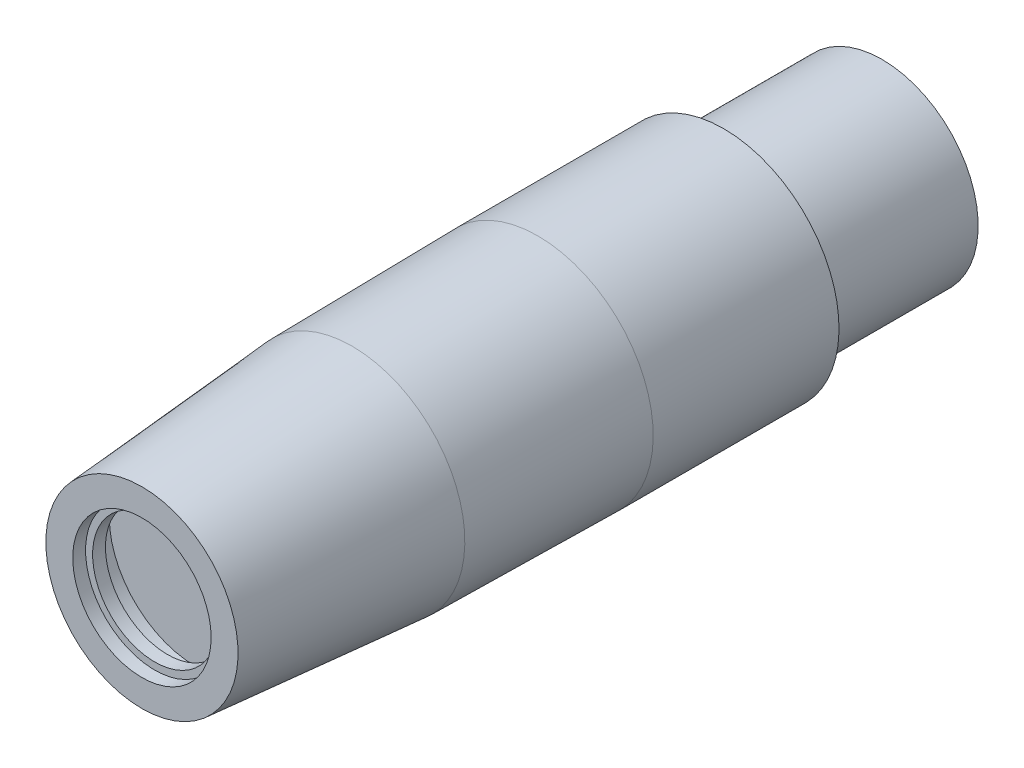
ISO-10303-21;
HEADER;
FILE_DESCRIPTION(('STEP AP214'),'2;1');
FILE_NAME('part.step','',(''),(''),'','','');
FILE_SCHEMA(('AUTOMOTIVE_DESIGN { 1 0 10303 214 1 1 1 1 }'));
ENDSEC;
DATA;
#1=APPLICATION_CONTEXT('core data for automotive mechanical design processes');
#2=APPLICATION_PROTOCOL_DEFINITION('international standard','automotive_design',2000,#1);
#3=PRODUCT_CONTEXT('',#1,'mechanical');
#4=PRODUCT('Part','Part','',(#3));
#5=PRODUCT_RELATED_PRODUCT_CATEGORY('part','',(#4));
#6=PRODUCT_DEFINITION_FORMATION('','',#4);
#7=PRODUCT_DEFINITION_CONTEXT('part definition',#1,'design');
#8=PRODUCT_DEFINITION('design','',#6,#7);
#9=PRODUCT_DEFINITION_SHAPE('','',#8);
#10=(LENGTH_UNIT() NAMED_UNIT(*) SI_UNIT(.MILLI.,.METRE.));
#11=(NAMED_UNIT(*) PLANE_ANGLE_UNIT() SI_UNIT($,.RADIAN.));
#12=(NAMED_UNIT(*) SI_UNIT($,.STERADIAN.) SOLID_ANGLE_UNIT());
#13=UNCERTAINTY_MEASURE_WITH_UNIT(LENGTH_MEASURE(1.E-05),#10,'distance_accuracy_value','');
#14=(GEOMETRIC_REPRESENTATION_CONTEXT(3) GLOBAL_UNCERTAINTY_ASSIGNED_CONTEXT((#13)) GLOBAL_UNIT_ASSIGNED_CONTEXT((#10,
#11,#12)) REPRESENTATION_CONTEXT('',''));
#15=CARTESIAN_POINT('',(0.,0.,0.));
#16=DIRECTION('',(0.,0.,1.));
#17=DIRECTION('',(1.,0.,0.));
#18=AXIS2_PLACEMENT_3D('',#15,#16,#17);
#19=CARTESIAN_POINT('',(0.,0.,0.));
#20=DIRECTION('',(0.,0.,1.));
#21=DIRECTION('',(0.,-1.,0.));
#22=AXIS2_PLACEMENT_3D('',#19,#20,#21);
#23=PLANE('',#22);
#24=CARTESIAN_POINT('',(0.,0.,0.));
#25=DIRECTION('',(0.,0.,1.));
#26=DIRECTION('',(1.,0.,0.));
#27=AXIS2_PLACEMENT_3D('',#24,#25,#26);
#28=CIRCLE('',#27,5.4);
#29=CARTESIAN_POINT('',(5.4,0.,0.));
#30=VERTEX_POINT('',#29);
#31=EDGE_CURVE('E173',#30,#30,#28,.T.);
#32=ORIENTED_EDGE('',*,*,#31,.F.);
#33=EDGE_LOOP('',(#32));
#34=FACE_BOUND('',#33,.T.);
#35=CARTESIAN_POINT('',(0.,0.,0.));
#36=DIRECTION('',(0.,0.,-1.));
#37=DIRECTION('',(0.,1.,0.));
#38=AXIS2_PLACEMENT_3D('',#35,#36,#37);
#39=CIRCLE('',#38,7.5);
#40=CARTESIAN_POINT('',(0.,7.5,0.));
#41=VERTEX_POINT('',#40);
#42=EDGE_CURVE('E11',#41,#41,#39,.T.);
#43=ORIENTED_EDGE('',*,*,#42,.F.);
#44=EDGE_LOOP('',(#43));
#45=FACE_BOUND('',#44,.T.);
#46=ADVANCED_FACE('F40',(#34,#45),#23,.T.);
#47=CARTESIAN_POINT('',(0.,0.,-16.4));
#48=DIRECTION('',(0.,0.,-1.));
#49=DIRECTION('',(0.,1.,0.));
#50=AXIS2_PLACEMENT_3D('',#47,#48,#49);
#51=CONICAL_SURFACE('',#50,8.8,0.0791028893789045);
#52=ORIENTED_EDGE('',*,*,#42,.T.);
#53=EDGE_LOOP('',(#52));
#54=FACE_BOUND('',#53,.T.);
#55=CARTESIAN_POINT('',(0.,0.,-16.4));
#56=DIRECTION('',(0.,0.,-1.));
#57=DIRECTION('',(0.,1.,0.));
#58=AXIS2_PLACEMENT_3D('',#55,#56,#57);
#59=CIRCLE('',#58,8.8);
#60=CARTESIAN_POINT('',(0.,8.8,-16.4));
#61=VERTEX_POINT('',#60);
#62=EDGE_CURVE('E47',#61,#61,#59,.T.);
#63=ORIENTED_EDGE('',*,*,#62,.F.);
#64=EDGE_LOOP('',(#63));
#65=FACE_BOUND('',#64,.T.);
#66=ADVANCED_FACE('F102',(#54,#65),#51,.T.);
#67=CARTESIAN_POINT('',(0.,0.,-30.9));
#68=DIRECTION('',(0.,0.,-1.));
#69=DIRECTION('',(0.,1.,0.));
#70=AXIS2_PLACEMENT_3D('',#67,#68,#69);
#71=CONICAL_SURFACE('',#70,9.,0.0137922288368334);
#72=ORIENTED_EDGE('',*,*,#62,.T.);
#73=EDGE_LOOP('',(#72));
#74=FACE_BOUND('',#73,.T.);
#75=CARTESIAN_POINT('',(0.,0.,-30.9));
#76=DIRECTION('',(0.,0.,-1.));
#77=DIRECTION('',(0.,1.,0.));
#78=AXIS2_PLACEMENT_3D('',#75,#76,#77);
#79=CIRCLE('',#78,9.);
#80=CARTESIAN_POINT('',(0.,9.,-30.9));
#81=VERTEX_POINT('',#80);
#82=EDGE_CURVE('E94',#81,#81,#79,.T.);
#83=ORIENTED_EDGE('',*,*,#82,.F.);
#84=EDGE_LOOP('',(#83));
#85=FACE_BOUND('',#84,.T.);
#86=ADVANCED_FACE('F99',(#74,#85),#71,.T.);
#87=CARTESIAN_POINT('',(0.,0.,-58.51));
#88=DIRECTION('',(0.,0.,-1.));
#89=DIRECTION('',(0.,1.,0.));
#90=AXIS2_PLACEMENT_3D('',#87,#88,#89);
#91=CYLINDRICAL_SURFACE('',#90,9.);
#92=ORIENTED_EDGE('',*,*,#82,.T.);
#93=EDGE_LOOP('',(#92));
#94=FACE_BOUND('',#93,.T.);
#95=CARTESIAN_POINT('',(0.,0.,-45.4));
#96=DIRECTION('',(0.,0.,-1.));
#97=DIRECTION('',(0.,1.,0.));
#98=AXIS2_PLACEMENT_3D('',#95,#96,#97);
#99=CIRCLE('',#98,9.);
#100=CARTESIAN_POINT('',(0.,9.,-45.4));
#101=VERTEX_POINT('',#100);
#102=EDGE_CURVE('E91',#101,#101,#99,.T.);
#103=ORIENTED_EDGE('',*,*,#102,.F.);
#104=EDGE_LOOP('',(#103));
#105=FACE_BOUND('',#104,.T.);
#106=ADVANCED_FACE('F109',(#94,#105),#91,.T.);
#107=CARTESIAN_POINT('',(0.,9.,-45.4));
#108=DIRECTION('',(0.,0.,-1.));
#109=DIRECTION('',(0.,1.,0.));
#110=AXIS2_PLACEMENT_3D('',#107,#108,#109);
#111=PLANE('',#110);
#112=ORIENTED_EDGE('',*,*,#102,.T.);
#113=EDGE_LOOP('',(#112));
#114=FACE_BOUND('',#113,.T.);
#115=CARTESIAN_POINT('',(0.,0.,-45.4));
#116=DIRECTION('',(0.,0.,-1.));
#117=DIRECTION('',(0.,1.,0.));
#118=AXIS2_PLACEMENT_3D('',#115,#116,#117);
#119=CIRCLE('',#118,7.5);
#120=CARTESIAN_POINT('',(0.,7.5,-45.4));
#121=VERTEX_POINT('',#120);
#122=EDGE_CURVE('E88',#121,#121,#119,.T.);
#123=ORIENTED_EDGE('',*,*,#122,.F.);
#124=EDGE_LOOP('',(#123));
#125=FACE_BOUND('',#124,.T.);
#126=ADVANCED_FACE('F115',(#114,#125),#111,.T.);
#127=CARTESIAN_POINT('',(0.,0.,-58.51));
#128=DIRECTION('',(0.,0.,-1.));
#129=DIRECTION('',(0.,1.,0.));
#130=AXIS2_PLACEMENT_3D('',#127,#128,#129);
#131=CYLINDRICAL_SURFACE('',#130,7.5);
#132=ORIENTED_EDGE('',*,*,#122,.T.);
#133=EDGE_LOOP('',(#132));
#134=FACE_BOUND('',#133,.T.);
#135=CARTESIAN_POINT('',(0.,0.,-57.76));
#136=DIRECTION('',(0.,0.,-1.));
#137=DIRECTION('',(0.,1.,0.));
#138=AXIS2_PLACEMENT_3D('',#135,#136,#137);
#139=CIRCLE('',#138,7.5);
#140=CARTESIAN_POINT('',(0.,7.5,-57.76));
#141=VERTEX_POINT('',#140);
#142=EDGE_CURVE('E81',#141,#141,#139,.T.);
#143=ORIENTED_EDGE('',*,*,#142,.F.);
#144=EDGE_LOOP('',(#143));
#145=FACE_BOUND('',#144,.T.);
#146=ADVANCED_FACE('F119',(#134,#145),#131,.T.);
#147=CARTESIAN_POINT('',(0.,7.5,-57.76));
#148=DIRECTION('',(0.,0.,-1.));
#149=DIRECTION('',(0.,1.,0.));
#150=AXIS2_PLACEMENT_3D('',#147,#148,#149);
#151=PLANE('',#150);
#152=ORIENTED_EDGE('',*,*,#142,.T.);
#153=EDGE_LOOP('',(#152));
#154=FACE_BOUND('',#153,.T.);
#155=CARTESIAN_POINT('',(0.,0.,-57.76));
#156=DIRECTION('',(0.,0.,-1.));
#157=DIRECTION('',(0.,1.,0.));
#158=AXIS2_PLACEMENT_3D('',#155,#156,#157);
#159=CIRCLE('',#158,6.125);
#160=CARTESIAN_POINT('',(3.83601355576333,4.775,-57.76));
#161=VERTEX_POINT('',#160);
#162=CARTESIAN_POINT('',(-3.83601355576333,4.775,-57.76));
#163=VERTEX_POINT('',#162);
#164=EDGE_CURVE('E77',#161,#163,#159,.T.);
#165=ORIENTED_EDGE('',*,*,#164,.F.);
#166=DIRECTION('',(1.,0.,0.));
#167=VECTOR('',#166,1.);
#168=CARTESIAN_POINT('',(3.83601355576333,4.775,-57.76));
#169=LINE('',#168,#167);
#170=EDGE_CURVE('E59',#163,#161,#169,.T.);
#171=ORIENTED_EDGE('',*,*,#170,.F.);
#172=EDGE_LOOP('',(#165,#171));
#173=FACE_BOUND('',#172,.T.);
#174=ADVANCED_FACE('F123',(#154,#173),#151,.T.);
#175=CARTESIAN_POINT('',(0.,0.,-58.51));
#176=DIRECTION('',(0.,0.,-1.));
#177=DIRECTION('',(0.,1.,0.));
#178=AXIS2_PLACEMENT_3D('',#175,#176,#177);
#179=CYLINDRICAL_SURFACE('',#178,6.125);
#180=DIRECTION('',(0.,0.,-1.));
#181=VECTOR('',#180,1.);
#182=CARTESIAN_POINT('',(-3.83601355576333,4.775,-49.9701026964407));
#183=LINE('',#182,#181);
#184=CARTESIAN_POINT('',(-3.83601355576333,4.775,-58.51));
#185=VERTEX_POINT('',#184);
#186=EDGE_CURVE('E66',#163,#185,#183,.T.);
#187=ORIENTED_EDGE('',*,*,#186,.T.);
#188=CARTESIAN_POINT('',(0.,0.,-58.51));
#189=DIRECTION('',(0.,0.,-1.));
#190=DIRECTION('',(0.,1.,0.));
#191=AXIS2_PLACEMENT_3D('',#188,#189,#190);
#192=CIRCLE('',#191,6.125);
#193=CARTESIAN_POINT('',(3.83601355576333,4.775,-58.51));
#194=VERTEX_POINT('',#193);
#195=EDGE_CURVE('E75',#194,#185,#192,.T.);
#196=ORIENTED_EDGE('',*,*,#195,.F.);
#197=DIRECTION('',(0.,0.,-1.));
#198=VECTOR('',#197,1.);
#199=CARTESIAN_POINT('',(3.83601355576333,4.775,-49.9701026964407));
#200=LINE('',#199,#198);
#201=EDGE_CURVE('E54',#161,#194,#200,.T.);
#202=ORIENTED_EDGE('',*,*,#201,.F.);
#203=ORIENTED_EDGE('',*,*,#164,.T.);
#204=EDGE_LOOP('',(#187,#196,#202,#203));
#205=FACE_BOUND('',#204,.T.);
#206=ADVANCED_FACE('F74',(#205),#179,.T.);
#207=CARTESIAN_POINT('',(0.,6.125,-58.51));
#208=DIRECTION('',(0.,0.,-1.));
#209=DIRECTION('',(0.,1.,0.));
#210=AXIS2_PLACEMENT_3D('',#207,#208,#209);
#211=PLANE('',#210);
#212=DIRECTION('',(-1.,0.,0.));
#213=VECTOR('',#212,1.);
#214=CARTESIAN_POINT('',(3.83601355576333,4.775,-58.51));
#215=LINE('',#214,#213);
#216=EDGE_CURVE('E63',#194,#185,#215,.T.);
#217=ORIENTED_EDGE('',*,*,#216,.F.);
#218=ORIENTED_EDGE('',*,*,#195,.T.);
#219=EDGE_LOOP('',(#217,#218));
#220=FACE_BOUND('',#219,.T.);
#221=ADVANCED_FACE('F79',(#220),#211,.T.);
#222=CARTESIAN_POINT('',(3.83601355576333,4.775,-49.9701026964407));
#223=DIRECTION('',(0.,-1.,0.));
#224=DIRECTION('',(0.,0.,-1.));
#225=AXIS2_PLACEMENT_3D('',#222,#223,#224);
#226=PLANE('',#225);
#227=ORIENTED_EDGE('',*,*,#170,.T.);
#228=ORIENTED_EDGE('',*,*,#201,.T.);
#229=ORIENTED_EDGE('',*,*,#216,.T.);
#230=ORIENTED_EDGE('',*,*,#186,.F.);
#231=EDGE_LOOP('',(#227,#228,#229,#230));
#232=FACE_BOUND('',#231,.T.);
#233=ADVANCED_FACE('F65',(#232),#226,.F.);
#234=CARTESIAN_POINT('',(0.,0.,-1.));
#235=DIRECTION('',(0.,0.,1.));
#236=DIRECTION('',(1.,0.,0.));
#237=AXIS2_PLACEMENT_3D('',#234,#235,#236);
#238=CYLINDRICAL_SURFACE('',#237,5.4);
#239=CARTESIAN_POINT('',(0.,0.,-1.));
#240=DIRECTION('',(0.,0.,1.));
#241=DIRECTION('',(1.,0.,0.));
#242=AXIS2_PLACEMENT_3D('',#239,#240,#241);
#243=CIRCLE('',#242,5.4);
#244=CARTESIAN_POINT('',(5.4,0.,-1.));
#245=VERTEX_POINT('',#244);
#246=EDGE_CURVE('E70',#245,#245,#243,.T.);
#247=ORIENTED_EDGE('',*,*,#246,.F.);
#248=EDGE_LOOP('',(#247));
#249=FACE_BOUND('',#248,.T.);
#250=ORIENTED_EDGE('',*,*,#31,.T.);
#251=EDGE_LOOP('',(#250));
#252=FACE_BOUND('',#251,.T.);
#253=ADVANCED_FACE('F134',(#249,#252),#238,.F.);
#254=CARTESIAN_POINT('',(0.,0.,-1.));
#255=DIRECTION('',(0.,0.,1.));
#256=DIRECTION('',(1.,0.,0.));
#257=AXIS2_PLACEMENT_3D('',#254,#255,#256);
#258=PLANE('',#257);
#259=CARTESIAN_POINT('',(0.,0.,-1.));
#260=DIRECTION('',(0.,0.,1.));
#261=DIRECTION('',(1.,0.,0.));
#262=AXIS2_PLACEMENT_3D('',#259,#260,#261);
#263=CIRCLE('',#262,4.85);
#264=CARTESIAN_POINT('',(4.85,0.,-1.));
#265=VERTEX_POINT('',#264);
#266=EDGE_CURVE('E166',#265,#265,#263,.T.);
#267=ORIENTED_EDGE('',*,*,#266,.F.);
#268=EDGE_LOOP('',(#267));
#269=FACE_BOUND('',#268,.T.);
#270=ORIENTED_EDGE('',*,*,#246,.T.);
#271=EDGE_LOOP('',(#270));
#272=FACE_BOUND('',#271,.T.);
#273=ADVANCED_FACE('F137',(#269,#272),#258,.T.);
#274=CARTESIAN_POINT('',(0.,0.,-2.));
#275=DIRECTION('',(0.,0.,1.));
#276=DIRECTION('',(1.,0.,0.));
#277=AXIS2_PLACEMENT_3D('',#274,#275,#276);
#278=CYLINDRICAL_SURFACE('',#277,4.85);
#279=CARTESIAN_POINT('',(0.,0.,-2.));
#280=DIRECTION('',(0.,0.,1.));
#281=DIRECTION('',(1.,0.,0.));
#282=AXIS2_PLACEMENT_3D('',#279,#280,#281);
#283=CIRCLE('',#282,4.85);
#284=CARTESIAN_POINT('',(4.85,0.,-2.));
#285=VERTEX_POINT('',#284);
#286=EDGE_CURVE('E162',#285,#285,#283,.T.);
#287=ORIENTED_EDGE('',*,*,#286,.F.);
#288=EDGE_LOOP('',(#287));
#289=FACE_BOUND('',#288,.T.);
#290=ORIENTED_EDGE('',*,*,#266,.T.);
#291=EDGE_LOOP('',(#290));
#292=FACE_BOUND('',#291,.T.);
#293=ADVANCED_FACE('F141',(#289,#292),#278,.F.);
#294=CARTESIAN_POINT('',(0.,0.,-4.2));
#295=DIRECTION('',(0.,0.,1.));
#296=DIRECTION('',(1.,0.,0.));
#297=AXIS2_PLACEMENT_3D('',#294,#295,#296);
#298=CYLINDRICAL_SURFACE('',#297,6.75);
#299=CARTESIAN_POINT('',(0.,0.,-4.2));
#300=DIRECTION('',(0.,0.,1.));
#301=DIRECTION('',(1.,0.,0.));
#302=AXIS2_PLACEMENT_3D('',#299,#300,#301);
#303=CIRCLE('',#302,6.75);
#304=CARTESIAN_POINT('',(6.75,0.,-4.2));
#305=VERTEX_POINT('',#304);
#306=EDGE_CURVE('E161',#305,#305,#303,.T.);
#307=ORIENTED_EDGE('',*,*,#306,.F.);
#308=EDGE_LOOP('',(#307));
#309=FACE_BOUND('',#308,.T.);
#310=CARTESIAN_POINT('',(0.,0.,-2.));
#311=DIRECTION('',(0.,0.,1.));
#312=DIRECTION('',(1.,0.,0.));
#313=AXIS2_PLACEMENT_3D('',#310,#311,#312);
#314=CIRCLE('',#313,6.75);
#315=CARTESIAN_POINT('',(6.75,0.,-2.));
#316=VERTEX_POINT('',#315);
#317=EDGE_CURVE('E163',#316,#316,#314,.T.);
#318=ORIENTED_EDGE('',*,*,#317,.T.);
#319=EDGE_LOOP('',(#318));
#320=FACE_BOUND('',#319,.T.);
#321=ADVANCED_FACE('F145',(#309,#320),#298,.F.);
#322=CARTESIAN_POINT('',(0.,0.,-4.2));
#323=DIRECTION('',(0.,0.,1.));
#324=DIRECTION('',(1.,0.,0.));
#325=AXIS2_PLACEMENT_3D('',#322,#323,#324);
#326=PLANE('',#325);
#327=ORIENTED_EDGE('',*,*,#306,.T.);
#328=EDGE_LOOP('',(#327));
#329=FACE_BOUND('',#328,.T.);
#330=ADVANCED_FACE('F149',(#329),#326,.T.);
#331=CARTESIAN_POINT('',(0.,0.,-2.));
#332=DIRECTION('',(0.,0.,1.));
#333=DIRECTION('',(1.,0.,0.));
#334=AXIS2_PLACEMENT_3D('',#331,#332,#333);
#335=PLANE('',#334);
#336=ORIENTED_EDGE('',*,*,#286,.T.);
#337=EDGE_LOOP('',(#336));
#338=FACE_BOUND('',#337,.T.);
#339=ORIENTED_EDGE('',*,*,#317,.F.);
#340=EDGE_LOOP('',(#339));
#341=FACE_BOUND('',#340,.T.);
#342=ADVANCED_FACE('F151',(#338,#341),#335,.F.);
#343=CLOSED_SHELL('',(#46,#66,#86,#106,#126,#146,#174,#206,#221,#233,#253,#273,#293,#321,#330,#342));
#344=MANIFOLD_SOLID_BREP('B2',#343);
#345=ADVANCED_BREP_SHAPE_REPRESENTATION('',(#18,#344),#14);
#346=SHAPE_DEFINITION_REPRESENTATION(#9,#345);
ENDSEC;
END-ISO-10303-21;
